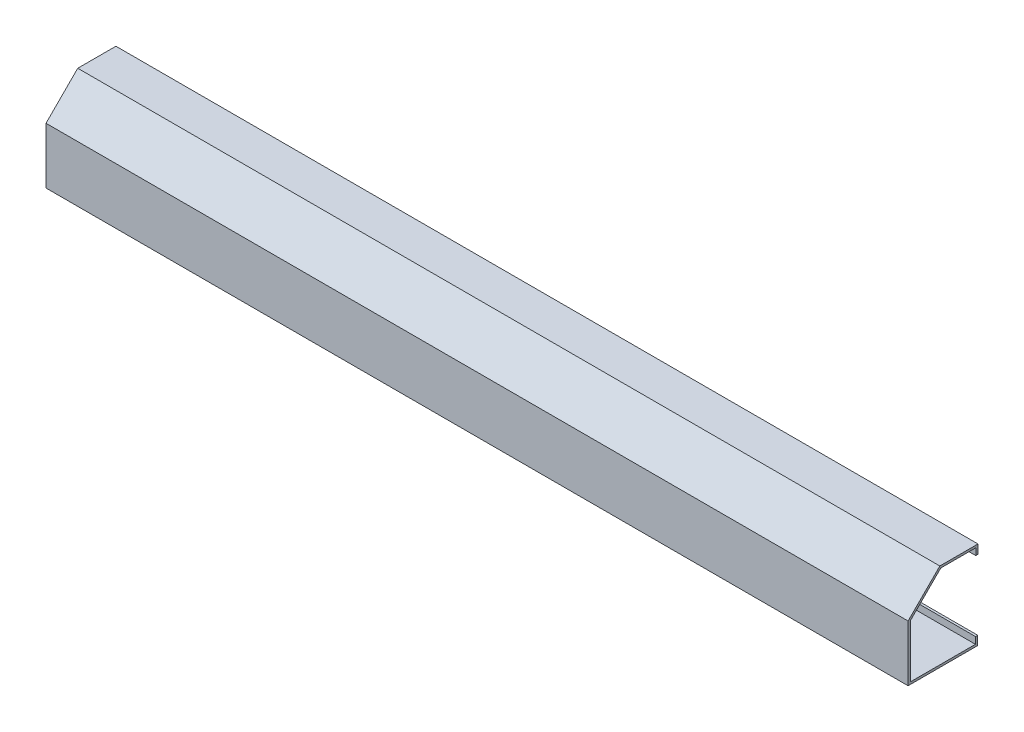
ISO-10303-21;
HEADER;
FILE_DESCRIPTION(('STEP AP214'),'2;1');
FILE_NAME('part.step','',(''),(''),'','','');
FILE_SCHEMA(('AUTOMOTIVE_DESIGN { 1 0 10303 214 1 1 1 1 }'));
ENDSEC;
DATA;
#1=APPLICATION_CONTEXT('core data for automotive mechanical design processes');
#2=APPLICATION_PROTOCOL_DEFINITION('international standard','automotive_design',2000,#1);
#3=PRODUCT_CONTEXT('',#1,'mechanical');
#4=PRODUCT('Part','Part','',(#3));
#5=PRODUCT_RELATED_PRODUCT_CATEGORY('part','',(#4));
#6=PRODUCT_DEFINITION_FORMATION('','',#4);
#7=PRODUCT_DEFINITION_CONTEXT('part definition',#1,'design');
#8=PRODUCT_DEFINITION('design','',#6,#7);
#9=PRODUCT_DEFINITION_SHAPE('','',#8);
#10=(LENGTH_UNIT() NAMED_UNIT(*) SI_UNIT(.MILLI.,.METRE.));
#11=(NAMED_UNIT(*) PLANE_ANGLE_UNIT() SI_UNIT($,.RADIAN.));
#12=(NAMED_UNIT(*) SI_UNIT($,.STERADIAN.) SOLID_ANGLE_UNIT());
#13=UNCERTAINTY_MEASURE_WITH_UNIT(LENGTH_MEASURE(1.E-05),#10,'distance_accuracy_value','');
#14=(GEOMETRIC_REPRESENTATION_CONTEXT(3) GLOBAL_UNCERTAINTY_ASSIGNED_CONTEXT((#13)) GLOBAL_UNIT_ASSIGNED_CONTEXT((#10,
#11,#12)) REPRESENTATION_CONTEXT('',''));
#15=CARTESIAN_POINT('',(0.,0.,0.));
#16=DIRECTION('',(0.,0.,1.));
#17=DIRECTION('',(1.,0.,0.));
#18=AXIS2_PLACEMENT_3D('',#15,#16,#17);
#19=CARTESIAN_POINT('',(2438.4,158.75,0.));
#20=DIRECTION('',(0.,0.,-1.));
#21=DIRECTION('',(0.,1.,0.));
#22=AXIS2_PLACEMENT_3D('',#19,#20,#21);
#23=PLANE('',#22);
#24=DIRECTION('',(0.,-1.,0.));
#25=VECTOR('',#24,1.);
#26=CARTESIAN_POINT('',(0.,158.75,0.));
#27=LINE('',#26,#25);
#28=CARTESIAN_POINT('',(0.,158.75,0.));
#29=VERTEX_POINT('',#28);
#30=CARTESIAN_POINT('',(0.,0.,0.));
#31=VERTEX_POINT('',#30);
#32=EDGE_CURVE('E180',#29,#31,#27,.T.);
#33=ORIENTED_EDGE('',*,*,#32,.T.);
#34=DIRECTION('',(-1.,0.,0.));
#35=VECTOR('',#34,1.);
#36=CARTESIAN_POINT('',(2438.4,0.,0.));
#37=LINE('',#36,#35);
#38=CARTESIAN_POINT('',(2438.4,0.,0.));
#39=VERTEX_POINT('',#38);
#40=EDGE_CURVE('E11',#39,#31,#37,.T.);
#41=ORIENTED_EDGE('',*,*,#40,.F.);
#42=DIRECTION('',(0.,-1.,0.));
#43=VECTOR('',#42,1.);
#44=CARTESIAN_POINT('',(2438.4,158.75,0.));
#45=LINE('',#44,#43);
#46=CARTESIAN_POINT('',(2438.4,158.75,0.));
#47=VERTEX_POINT('',#46);
#48=EDGE_CURVE('E220',#47,#39,#45,.T.);
#49=ORIENTED_EDGE('',*,*,#48,.F.);
#50=DIRECTION('',(-1.,0.,0.));
#51=VECTOR('',#50,1.);
#52=CARTESIAN_POINT('',(2438.4,158.75,0.));
#53=LINE('',#52,#51);
#54=EDGE_CURVE('E176',#47,#29,#53,.T.);
#55=ORIENTED_EDGE('',*,*,#54,.T.);
#56=EDGE_LOOP('',(#33,#41,#49,#55));
#57=FACE_BOUND('',#56,.T.);
#58=ADVANCED_FACE('F43',(#57),#23,.F.);
#59=CARTESIAN_POINT('',(2438.4,0.,0.));
#60=DIRECTION('',(0.,1.,0.));
#61=DIRECTION('',(0.,0.,1.));
#62=AXIS2_PLACEMENT_3D('',#59,#60,#61);
#63=PLANE('',#62);
#64=DIRECTION('',(0.,0.,-1.));
#65=VECTOR('',#64,1.);
#66=CARTESIAN_POINT('',(0.,0.,0.));
#67=LINE('',#66,#65);
#68=CARTESIAN_POINT('',(0.,0.,-196.85));
#69=VERTEX_POINT('',#68);
#70=EDGE_CURVE('E184',#31,#69,#67,.T.);
#71=ORIENTED_EDGE('',*,*,#70,.T.);
#72=DIRECTION('',(-1.,0.,0.));
#73=VECTOR('',#72,1.);
#74=CARTESIAN_POINT('',(2438.4,0.,-196.85));
#75=LINE('',#74,#73);
#76=CARTESIAN_POINT('',(2438.4,0.,-196.85));
#77=VERTEX_POINT('',#76);
#78=EDGE_CURVE('E52',#77,#69,#75,.T.);
#79=ORIENTED_EDGE('',*,*,#78,.F.);
#80=DIRECTION('',(0.,0.,-1.));
#81=VECTOR('',#80,1.);
#82=CARTESIAN_POINT('',(2438.4,0.,0.));
#83=LINE('',#82,#81);
#84=EDGE_CURVE('E121',#39,#77,#83,.T.);
#85=ORIENTED_EDGE('',*,*,#84,.F.);
#86=ORIENTED_EDGE('',*,*,#40,.T.);
#87=EDGE_LOOP('',(#71,#79,#85,#86));
#88=FACE_BOUND('',#87,.T.);
#89=ADVANCED_FACE('F328',(#88),#63,.F.);
#90=CARTESIAN_POINT('',(2438.4,0.,-196.85));
#91=DIRECTION('',(0.,0.,1.));
#92=DIRECTION('',(1.,0.,0.));
#93=AXIS2_PLACEMENT_3D('',#90,#91,#92);
#94=PLANE('',#93);
#95=DIRECTION('',(0.,1.,0.));
#96=VECTOR('',#95,1.);
#97=CARTESIAN_POINT('',(0.,0.,-196.85));
#98=LINE('',#97,#96);
#99=CARTESIAN_POINT('',(0.,25.4,-196.85));
#100=VERTEX_POINT('',#99);
#101=EDGE_CURVE('E187',#69,#100,#98,.T.);
#102=ORIENTED_EDGE('',*,*,#101,.T.);
#103=DIRECTION('',(-1.,0.,0.));
#104=VECTOR('',#103,1.);
#105=CARTESIAN_POINT('',(2438.4,25.4,-196.85));
#106=LINE('',#105,#104);
#107=CARTESIAN_POINT('',(2438.4,25.4,-196.85));
#108=VERTEX_POINT('',#107);
#109=EDGE_CURVE('E255',#108,#100,#106,.T.);
#110=ORIENTED_EDGE('',*,*,#109,.F.);
#111=DIRECTION('',(0.,1.,0.));
#112=VECTOR('',#111,1.);
#113=CARTESIAN_POINT('',(2438.4,0.,-196.85));
#114=LINE('',#113,#112);
#115=EDGE_CURVE('E265',#77,#108,#114,.T.);
#116=ORIENTED_EDGE('',*,*,#115,.F.);
#117=ORIENTED_EDGE('',*,*,#78,.T.);
#118=EDGE_LOOP('',(#102,#110,#116,#117));
#119=FACE_BOUND('',#118,.T.);
#120=ADVANCED_FACE('F263',(#119),#94,.F.);
#121=CARTESIAN_POINT('',(2438.4,25.4,-196.85));
#122=DIRECTION('',(0.,-1.,0.));
#123=DIRECTION('',(0.,0.,-1.));
#124=AXIS2_PLACEMENT_3D('',#121,#122,#123);
#125=PLANE('',#124);
#126=DIRECTION('',(0.,0.,1.));
#127=VECTOR('',#126,1.);
#128=CARTESIAN_POINT('',(0.,25.4,-196.85));
#129=LINE('',#128,#127);
#130=CARTESIAN_POINT('',(0.,25.4,-190.5));
#131=VERTEX_POINT('',#130);
#132=EDGE_CURVE('E190',#100,#131,#129,.T.);
#133=ORIENTED_EDGE('',*,*,#132,.T.);
#134=DIRECTION('',(-1.,0.,0.));
#135=VECTOR('',#134,1.);
#136=CARTESIAN_POINT('',(2438.4,25.4,-190.5));
#137=LINE('',#136,#135);
#138=CARTESIAN_POINT('',(2438.4,25.4,-190.5));
#139=VERTEX_POINT('',#138);
#140=EDGE_CURVE('E251',#139,#131,#137,.T.);
#141=ORIENTED_EDGE('',*,*,#140,.F.);
#142=DIRECTION('',(0.,0.,1.));
#143=VECTOR('',#142,1.);
#144=CARTESIAN_POINT('',(2438.4,25.4,-196.85));
#145=LINE('',#144,#143);
#146=EDGE_CURVE('E284',#108,#139,#145,.T.);
#147=ORIENTED_EDGE('',*,*,#146,.F.);
#148=ORIENTED_EDGE('',*,*,#109,.T.);
#149=EDGE_LOOP('',(#133,#141,#147,#148));
#150=FACE_BOUND('',#149,.T.);
#151=ADVANCED_FACE('F274',(#150),#125,.F.);
#152=CARTESIAN_POINT('',(2438.4,25.4,-190.5));
#153=DIRECTION('',(0.,0.,-1.));
#154=DIRECTION('',(-1.,0.,0.));
#155=AXIS2_PLACEMENT_3D('',#152,#153,#154);
#156=PLANE('',#155);
#157=DIRECTION('',(0.,-1.,0.));
#158=VECTOR('',#157,1.);
#159=CARTESIAN_POINT('',(0.,25.4,-190.5));
#160=LINE('',#159,#158);
#161=CARTESIAN_POINT('',(0.,6.35,-190.5));
#162=VERTEX_POINT('',#161);
#163=EDGE_CURVE('E193',#131,#162,#160,.T.);
#164=ORIENTED_EDGE('',*,*,#163,.T.);
#165=DIRECTION('',(-1.,0.,0.));
#166=VECTOR('',#165,1.);
#167=CARTESIAN_POINT('',(2438.4,6.35,-190.5));
#168=LINE('',#167,#166);
#169=CARTESIAN_POINT('',(2438.4,6.35,-190.5));
#170=VERTEX_POINT('',#169);
#171=EDGE_CURVE('E247',#170,#162,#168,.T.);
#172=ORIENTED_EDGE('',*,*,#171,.F.);
#173=DIRECTION('',(0.,-1.,0.));
#174=VECTOR('',#173,1.);
#175=CARTESIAN_POINT('',(2438.4,25.4,-190.5));
#176=LINE('',#175,#174);
#177=EDGE_CURVE('E280',#139,#170,#176,.T.);
#178=ORIENTED_EDGE('',*,*,#177,.F.);
#179=ORIENTED_EDGE('',*,*,#140,.T.);
#180=EDGE_LOOP('',(#164,#172,#178,#179));
#181=FACE_BOUND('',#180,.T.);
#182=ADVANCED_FACE('F278',(#181),#156,.F.);
#183=CARTESIAN_POINT('',(2438.4,6.35,-190.5));
#184=DIRECTION('',(0.,-1.,0.));
#185=DIRECTION('',(0.,0.,-1.));
#186=AXIS2_PLACEMENT_3D('',#183,#184,#185);
#187=PLANE('',#186);
#188=DIRECTION('',(0.,0.,1.));
#189=VECTOR('',#188,1.);
#190=CARTESIAN_POINT('',(0.,6.35,-190.5));
#191=LINE('',#190,#189);
#192=CARTESIAN_POINT('',(0.,6.34999999999998,-6.35000000000002));
#193=VERTEX_POINT('',#192);
#194=EDGE_CURVE('E196',#162,#193,#191,.T.);
#195=ORIENTED_EDGE('',*,*,#194,.T.);
#196=DIRECTION('',(-1.,0.,0.));
#197=VECTOR('',#196,1.);
#198=CARTESIAN_POINT('',(2438.4,6.34999999999998,-6.35000000000002));
#199=LINE('',#198,#197);
#200=CARTESIAN_POINT('',(2438.4,6.34999999999998,-6.35000000000002));
#201=VERTEX_POINT('',#200);
#202=EDGE_CURVE('E243',#201,#193,#199,.T.);
#203=ORIENTED_EDGE('',*,*,#202,.F.);
#204=DIRECTION('',(0.,0.,1.));
#205=VECTOR('',#204,1.);
#206=CARTESIAN_POINT('',(2438.4,6.35,-190.5));
#207=LINE('',#206,#205);
#208=EDGE_CURVE('E283',#170,#201,#207,.T.);
#209=ORIENTED_EDGE('',*,*,#208,.F.);
#210=ORIENTED_EDGE('',*,*,#171,.T.);
#211=EDGE_LOOP('',(#195,#203,#209,#210));
#212=FACE_BOUND('',#211,.T.);
#213=ADVANCED_FACE('F341',(#212),#187,.F.);
#214=CARTESIAN_POINT('',(2438.4,6.34999999999998,-6.35000000000002));
#215=DIRECTION('',(0.,0.,1.));
#216=DIRECTION('',(0.,-1.,0.));
#217=AXIS2_PLACEMENT_3D('',#214,#215,#216);
#218=PLANE('',#217);
#219=DIRECTION('',(0.,1.,0.));
#220=VECTOR('',#219,1.);
#221=CARTESIAN_POINT('',(0.,6.34999999999998,-6.35000000000002));
#222=LINE('',#221,#220);
#223=CARTESIAN_POINT('',(0.,156.119743878931,-6.35000000000002));
#224=VERTEX_POINT('',#223);
#225=EDGE_CURVE('E199',#193,#224,#222,.T.);
#226=ORIENTED_EDGE('',*,*,#225,.T.);
#227=DIRECTION('',(-1.,0.,0.));
#228=VECTOR('',#227,1.);
#229=CARTESIAN_POINT('',(2438.4,156.119743878931,-6.35000000000002));
#230=LINE('',#229,#228);
#231=CARTESIAN_POINT('',(2438.4,156.119743878931,-6.35000000000002));
#232=VERTEX_POINT('',#231);
#233=EDGE_CURVE('E239',#232,#224,#230,.T.);
#234=ORIENTED_EDGE('',*,*,#233,.F.);
#235=DIRECTION('',(0.,1.,0.));
#236=VECTOR('',#235,1.);
#237=CARTESIAN_POINT('',(2438.4,6.34999999999998,-6.35000000000002));
#238=LINE('',#237,#236);
#239=EDGE_CURVE('E288',#201,#232,#238,.T.);
#240=ORIENTED_EDGE('',*,*,#239,.F.);
#241=ORIENTED_EDGE('',*,*,#202,.T.);
#242=EDGE_LOOP('',(#226,#234,#240,#241));
#243=FACE_BOUND('',#242,.T.);
#244=ADVANCED_FACE('F344',(#243),#218,.F.);
#245=CARTESIAN_POINT('',(2438.4,156.119743878931,-6.35000000000002));
#246=DIRECTION('',(0.,0.707106781186544,0.707106781186551));
#247=DIRECTION('',(0.,-0.707106781186551,0.707106781186544));
#248=AXIS2_PLACEMENT_3D('',#245,#246,#247);
#249=PLANE('',#248);
#250=DIRECTION('',(0.,0.707106781186551,-0.707106781186544));
#251=VECTOR('',#250,1.);
#252=CARTESIAN_POINT('',(0.,156.119743878931,-6.35000000000002));
#253=LINE('',#252,#251);
#254=CARTESIAN_POINT('',(0.,242.202561210692,-92.4328173317604));
#255=VERTEX_POINT('',#254);
#256=EDGE_CURVE('E202',#224,#255,#253,.T.);
#257=ORIENTED_EDGE('',*,*,#256,.T.);
#258=DIRECTION('',(-1.,0.,0.));
#259=VECTOR('',#258,1.);
#260=CARTESIAN_POINT('',(2438.4,242.202561210692,-92.4328173317604));
#261=LINE('',#260,#259);
#262=CARTESIAN_POINT('',(2438.4,242.202561210692,-92.4328173317604));
#263=VERTEX_POINT('',#262);
#264=EDGE_CURVE('E235',#263,#255,#261,.T.);
#265=ORIENTED_EDGE('',*,*,#264,.F.);
#266=DIRECTION('',(0.,0.707106781186551,-0.707106781186544));
#267=VECTOR('',#266,1.);
#268=CARTESIAN_POINT('',(2438.4,156.119743878931,-6.35000000000002));
#269=LINE('',#268,#267);
#270=EDGE_CURVE('E295',#232,#263,#269,.T.);
#271=ORIENTED_EDGE('',*,*,#270,.F.);
#272=ORIENTED_EDGE('',*,*,#233,.T.);
#273=EDGE_LOOP('',(#257,#265,#271,#272));
#274=FACE_BOUND('',#273,.T.);
#275=ADVANCED_FACE('F348',(#274),#249,.F.);
#276=CARTESIAN_POINT('',(2438.4,242.202561210692,-92.4328173317604));
#277=DIRECTION('',(0.,1.,0.));
#278=DIRECTION('',(0.,0.,1.));
#279=AXIS2_PLACEMENT_3D('',#276,#277,#278);
#280=PLANE('',#279);
#281=DIRECTION('',(0.,0.,-1.));
#282=VECTOR('',#281,1.);
#283=CARTESIAN_POINT('',(0.,242.202561210692,-92.4328173317604));
#284=LINE('',#283,#282);
#285=CARTESIAN_POINT('',(0.,242.202561210692,-191.402561210691));
#286=VERTEX_POINT('',#285);
#287=EDGE_CURVE('E205',#255,#286,#284,.T.);
#288=ORIENTED_EDGE('',*,*,#287,.T.);
#289=DIRECTION('',(-1.,0.,0.));
#290=VECTOR('',#289,1.);
#291=CARTESIAN_POINT('',(2438.4,242.202561210692,-191.402561210691));
#292=LINE('',#291,#290);
#293=CARTESIAN_POINT('',(2438.4,242.202561210692,-191.402561210691));
#294=VERTEX_POINT('',#293);
#295=EDGE_CURVE('E231',#294,#286,#292,.T.);
#296=ORIENTED_EDGE('',*,*,#295,.F.);
#297=DIRECTION('',(0.,0.,-1.));
#298=VECTOR('',#297,1.);
#299=CARTESIAN_POINT('',(2438.4,242.202561210692,-92.4328173317604));
#300=LINE('',#299,#298);
#301=EDGE_CURVE('E298',#263,#294,#300,.T.);
#302=ORIENTED_EDGE('',*,*,#301,.F.);
#303=ORIENTED_EDGE('',*,*,#264,.T.);
#304=EDGE_LOOP('',(#288,#296,#302,#303));
#305=FACE_BOUND('',#304,.T.);
#306=ADVANCED_FACE('F352',(#305),#280,.F.);
#307=CARTESIAN_POINT('',(2438.4,242.202561210692,-191.402561210691));
#308=DIRECTION('',(0.,0.,-1.));
#309=DIRECTION('',(0.,1.,0.));
#310=AXIS2_PLACEMENT_3D('',#307,#308,#309);
#311=PLANE('',#310);
#312=DIRECTION('',(0.,-1.,0.));
#313=VECTOR('',#312,1.);
#314=CARTESIAN_POINT('',(0.,242.202561210692,-191.402561210691));
#315=LINE('',#314,#313);
#316=CARTESIAN_POINT('',(0.,223.152561210692,-191.402561210691));
#317=VERTEX_POINT('',#316);
#318=EDGE_CURVE('E208',#286,#317,#315,.T.);
#319=ORIENTED_EDGE('',*,*,#318,.T.);
#320=DIRECTION('',(-1.,0.,0.));
#321=VECTOR('',#320,1.);
#322=CARTESIAN_POINT('',(2438.4,223.152561210692,-191.402561210691));
#323=LINE('',#322,#321);
#324=CARTESIAN_POINT('',(2438.4,223.152561210692,-191.402561210691));
#325=VERTEX_POINT('',#324);
#326=EDGE_CURVE('E227',#325,#317,#323,.T.);
#327=ORIENTED_EDGE('',*,*,#326,.F.);
#328=DIRECTION('',(0.,-1.,0.));
#329=VECTOR('',#328,1.);
#330=CARTESIAN_POINT('',(2438.4,242.202561210692,-191.402561210691));
#331=LINE('',#330,#329);
#332=EDGE_CURVE('E301',#294,#325,#331,.T.);
#333=ORIENTED_EDGE('',*,*,#332,.F.);
#334=ORIENTED_EDGE('',*,*,#295,.T.);
#335=EDGE_LOOP('',(#319,#327,#333,#334));
#336=FACE_BOUND('',#335,.T.);
#337=ADVANCED_FACE('F309',(#336),#311,.F.);
#338=CARTESIAN_POINT('',(2438.4,223.152561210692,-191.402561210691));
#339=DIRECTION('',(0.,1.,0.));
#340=DIRECTION('',(0.,0.,1.));
#341=AXIS2_PLACEMENT_3D('',#338,#339,#340);
#342=PLANE('',#341);
#343=DIRECTION('',(0.,0.,-1.));
#344=VECTOR('',#343,1.);
#345=CARTESIAN_POINT('',(0.,223.152561210692,-191.402561210691));
#346=LINE('',#345,#344);
#347=CARTESIAN_POINT('',(0.,223.152561210692,-197.752561210691));
#348=VERTEX_POINT('',#347);
#349=EDGE_CURVE('E211',#317,#348,#346,.T.);
#350=ORIENTED_EDGE('',*,*,#349,.T.);
#351=DIRECTION('',(-1.,0.,0.));
#352=VECTOR('',#351,1.);
#353=CARTESIAN_POINT('',(2438.4,223.152561210692,-197.752561210691));
#354=LINE('',#353,#352);
#355=CARTESIAN_POINT('',(2438.4,223.152561210692,-197.752561210691));
#356=VERTEX_POINT('',#355);
#357=EDGE_CURVE('E169',#356,#348,#354,.T.);
#358=ORIENTED_EDGE('',*,*,#357,.F.);
#359=DIRECTION('',(0.,0.,-1.));
#360=VECTOR('',#359,1.);
#361=CARTESIAN_POINT('',(2438.4,223.152561210692,-191.402561210691));
#362=LINE('',#361,#360);
#363=EDGE_CURVE('E158',#325,#356,#362,.T.);
#364=ORIENTED_EDGE('',*,*,#363,.F.);
#365=ORIENTED_EDGE('',*,*,#326,.T.);
#366=EDGE_LOOP('',(#350,#358,#364,#365));
#367=FACE_BOUND('',#366,.T.);
#368=ADVANCED_FACE('F313',(#367),#342,.F.);
#369=CARTESIAN_POINT('',(2438.4,223.152561210692,-197.752561210691));
#370=DIRECTION('',(0.,0.,1.));
#371=DIRECTION('',(1.,0.,0.));
#372=AXIS2_PLACEMENT_3D('',#369,#370,#371);
#373=PLANE('',#372);
#374=DIRECTION('',(0.,1.,0.));
#375=VECTOR('',#374,1.);
#376=CARTESIAN_POINT('',(0.,223.152561210692,-197.752561210691));
#377=LINE('',#376,#375);
#378=CARTESIAN_POINT('',(0.,248.552561210692,-197.752561210691));
#379=VERTEX_POINT('',#378);
#380=EDGE_CURVE('E167',#348,#379,#377,.T.);
#381=ORIENTED_EDGE('',*,*,#380,.T.);
#382=DIRECTION('',(-1.,0.,0.));
#383=VECTOR('',#382,1.);
#384=CARTESIAN_POINT('',(2438.4,248.552561210692,-197.752561210691));
#385=LINE('',#384,#383);
#386=CARTESIAN_POINT('',(2438.4,248.552561210692,-197.752561210691));
#387=VERTEX_POINT('',#386);
#388=EDGE_CURVE('E164',#387,#379,#385,.T.);
#389=ORIENTED_EDGE('',*,*,#388,.F.);
#390=DIRECTION('',(0.,1.,0.));
#391=VECTOR('',#390,1.);
#392=CARTESIAN_POINT('',(2438.4,223.152561210692,-197.752561210691));
#393=LINE('',#392,#391);
#394=EDGE_CURVE('E152',#356,#387,#393,.T.);
#395=ORIENTED_EDGE('',*,*,#394,.F.);
#396=ORIENTED_EDGE('',*,*,#357,.T.);
#397=EDGE_LOOP('',(#381,#389,#395,#396));
#398=FACE_BOUND('',#397,.T.);
#399=ADVANCED_FACE('F165',(#398),#373,.F.);
#400=CARTESIAN_POINT('',(2438.4,248.552561210692,-197.752561210691));
#401=DIRECTION('',(0.,-1.,0.));
#402=DIRECTION('',(0.,0.,-1.));
#403=AXIS2_PLACEMENT_3D('',#400,#401,#402);
#404=PLANE('',#403);
#405=DIRECTION('',(0.,0.,1.));
#406=VECTOR('',#405,1.);
#407=CARTESIAN_POINT('',(0.,248.552561210692,-197.752561210691));
#408=LINE('',#407,#406);
#409=CARTESIAN_POINT('',(0.,248.552561210692,-89.8025612106911));
#410=VERTEX_POINT('',#409);
#411=EDGE_CURVE('E107',#379,#410,#408,.T.);
#412=ORIENTED_EDGE('',*,*,#411,.T.);
#413=DIRECTION('',(-1.,0.,0.));
#414=VECTOR('',#413,1.);
#415=CARTESIAN_POINT('',(2438.4,248.552561210692,-89.8025612106911));
#416=LINE('',#415,#414);
#417=CARTESIAN_POINT('',(2438.4,248.552561210692,-89.8025612106911));
#418=VERTEX_POINT('',#417);
#419=EDGE_CURVE('E170',#418,#410,#416,.T.);
#420=ORIENTED_EDGE('',*,*,#419,.F.);
#421=DIRECTION('',(0.,0.,1.));
#422=VECTOR('',#421,1.);
#423=CARTESIAN_POINT('',(2438.4,248.552561210692,-197.752561210691));
#424=LINE('',#423,#422);
#425=EDGE_CURVE('E156',#387,#418,#424,.T.);
#426=ORIENTED_EDGE('',*,*,#425,.F.);
#427=ORIENTED_EDGE('',*,*,#388,.T.);
#428=EDGE_LOOP('',(#412,#420,#426,#427));
#429=FACE_BOUND('',#428,.T.);
#430=ADVANCED_FACE('F172',(#429),#404,.F.);
#431=CARTESIAN_POINT('',(2438.4,248.552561210692,-89.8025612106911));
#432=DIRECTION('',(0.,-0.707106781186544,-0.707106781186551));
#433=DIRECTION('',(0.,0.707106781186551,-0.707106781186544));
#434=AXIS2_PLACEMENT_3D('',#431,#432,#433);
#435=PLANE('',#434);
#436=DIRECTION('',(0.,-0.707106781186551,0.707106781186544));
#437=VECTOR('',#436,1.);
#438=CARTESIAN_POINT('',(0.,248.552561210692,-89.8025612106911));
#439=LINE('',#438,#437);
#440=EDGE_CURVE('E113',#410,#29,#439,.T.);
#441=ORIENTED_EDGE('',*,*,#440,.T.);
#442=ORIENTED_EDGE('',*,*,#54,.F.);
#443=DIRECTION('',(0.,-0.707106781186551,0.707106781186544));
#444=VECTOR('',#443,1.);
#445=CARTESIAN_POINT('',(2438.4,248.552561210692,-89.8025612106911));
#446=LINE('',#445,#444);
#447=EDGE_CURVE('E60',#418,#47,#446,.T.);
#448=ORIENTED_EDGE('',*,*,#447,.F.);
#449=ORIENTED_EDGE('',*,*,#419,.T.);
#450=EDGE_LOOP('',(#441,#442,#448,#449));
#451=FACE_BOUND('',#450,.T.);
#452=ADVANCED_FACE('F317',(#451),#435,.F.);
#453=CARTESIAN_POINT('',(2438.4,0.,0.));
#454=DIRECTION('',(1.,0.,0.));
#455=DIRECTION('',(0.,0.,-1.));
#456=AXIS2_PLACEMENT_3D('',#453,#454,#455);
#457=PLANE('',#456);
#458=ORIENTED_EDGE('',*,*,#48,.T.);
#459=ORIENTED_EDGE('',*,*,#84,.T.);
#460=ORIENTED_EDGE('',*,*,#115,.T.);
#461=ORIENTED_EDGE('',*,*,#146,.T.);
#462=ORIENTED_EDGE('',*,*,#177,.T.);
#463=ORIENTED_EDGE('',*,*,#208,.T.);
#464=ORIENTED_EDGE('',*,*,#239,.T.);
#465=ORIENTED_EDGE('',*,*,#270,.T.);
#466=ORIENTED_EDGE('',*,*,#301,.T.);
#467=ORIENTED_EDGE('',*,*,#332,.T.);
#468=ORIENTED_EDGE('',*,*,#363,.T.);
#469=ORIENTED_EDGE('',*,*,#394,.T.);
#470=ORIENTED_EDGE('',*,*,#425,.T.);
#471=ORIENTED_EDGE('',*,*,#447,.T.);
#472=EDGE_LOOP('',(#458,#459,#460,#461,#462,#463,#464,#465,#466,#467,#468,#469,#470,#471));
#473=FACE_BOUND('',#472,.T.);
#474=ADVANCED_FACE('F154',(#473),#457,.T.);
#475=CARTESIAN_POINT('',(0.,0.,0.));
#476=DIRECTION('',(1.,0.,0.));
#477=DIRECTION('',(0.,0.,-1.));
#478=AXIS2_PLACEMENT_3D('',#475,#476,#477);
#479=PLANE('',#478);
#480=ORIENTED_EDGE('',*,*,#32,.F.);
#481=ORIENTED_EDGE('',*,*,#440,.F.);
#482=ORIENTED_EDGE('',*,*,#411,.F.);
#483=ORIENTED_EDGE('',*,*,#380,.F.);
#484=ORIENTED_EDGE('',*,*,#349,.F.);
#485=ORIENTED_EDGE('',*,*,#318,.F.);
#486=ORIENTED_EDGE('',*,*,#287,.F.);
#487=ORIENTED_EDGE('',*,*,#256,.F.);
#488=ORIENTED_EDGE('',*,*,#225,.F.);
#489=ORIENTED_EDGE('',*,*,#194,.F.);
#490=ORIENTED_EDGE('',*,*,#163,.F.);
#491=ORIENTED_EDGE('',*,*,#132,.F.);
#492=ORIENTED_EDGE('',*,*,#101,.F.);
#493=ORIENTED_EDGE('',*,*,#70,.F.);
#494=EDGE_LOOP('',(#480,#481,#482,#483,#484,#485,#486,#487,#488,#489,#490,#491,#492,#493));
#495=FACE_BOUND('',#494,.T.);
#496=ADVANCED_FACE('F269',(#495),#479,.F.);
#497=CLOSED_SHELL('',(#58,#89,#120,#151,#182,#213,#244,#275,#306,#337,#368,#399,#430,#452,#474,#496));
#498=MANIFOLD_SOLID_BREP('B2',#497);
#499=ADVANCED_BREP_SHAPE_REPRESENTATION('',(#18,#498),#14);
#500=SHAPE_DEFINITION_REPRESENTATION(#9,#499);
ENDSEC;
END-ISO-10303-21;
